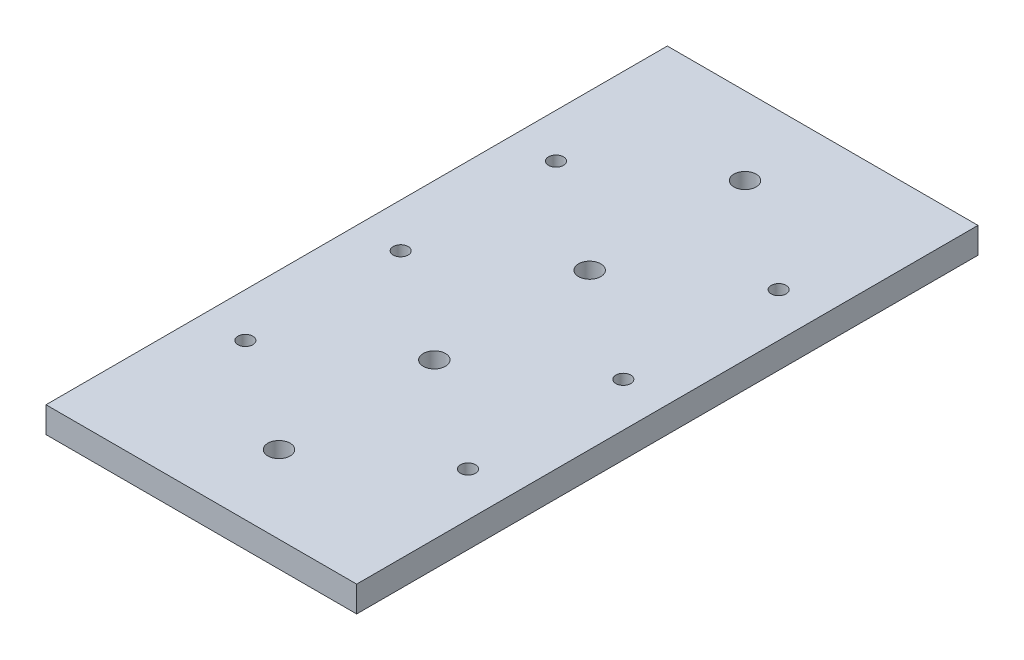
ISO-10303-21;
HEADER;
FILE_DESCRIPTION(('STEP AP214'),'2;1');
FILE_NAME('part.step','',(''),(''),'','','');
FILE_SCHEMA(('AUTOMOTIVE_DESIGN { 1 0 10303 214 1 1 1 1 }'));
ENDSEC;
DATA;
#1=APPLICATION_CONTEXT('core data for automotive mechanical design processes');
#2=APPLICATION_PROTOCOL_DEFINITION('international standard','automotive_design',2000,#1);
#3=PRODUCT_CONTEXT('',#1,'mechanical');
#4=PRODUCT('Part','Part','',(#3));
#5=PRODUCT_RELATED_PRODUCT_CATEGORY('part','',(#4));
#6=PRODUCT_DEFINITION_FORMATION('','',#4);
#7=PRODUCT_DEFINITION_CONTEXT('part definition',#1,'design');
#8=PRODUCT_DEFINITION('design','',#6,#7);
#9=PRODUCT_DEFINITION_SHAPE('','',#8);
#10=(LENGTH_UNIT() NAMED_UNIT(*) SI_UNIT(.MILLI.,.METRE.));
#11=(NAMED_UNIT(*) PLANE_ANGLE_UNIT() SI_UNIT($,.RADIAN.));
#12=(NAMED_UNIT(*) SI_UNIT($,.STERADIAN.) SOLID_ANGLE_UNIT());
#13=UNCERTAINTY_MEASURE_WITH_UNIT(LENGTH_MEASURE(1.E-05),#10,'distance_accuracy_value','');
#14=(GEOMETRIC_REPRESENTATION_CONTEXT(3) GLOBAL_UNCERTAINTY_ASSIGNED_CONTEXT((#13)) GLOBAL_UNIT_ASSIGNED_CONTEXT((#10,
#11,#12)) REPRESENTATION_CONTEXT('',''));
#15=CARTESIAN_POINT('',(0.,0.,0.));
#16=DIRECTION('',(0.,0.,1.));
#17=DIRECTION('',(1.,0.,0.));
#18=AXIS2_PLACEMENT_3D('',#15,#16,#17);
#19=CARTESIAN_POINT('',(38.1,-6.35,-76.2));
#20=DIRECTION('',(1.,0.,0.));
#21=DIRECTION('',(0.,0.,-1.));
#22=AXIS2_PLACEMENT_3D('',#19,#20,#21);
#23=PLANE('',#22);
#24=DIRECTION('',(0.,0.,-1.));
#25=VECTOR('',#24,1.);
#26=CARTESIAN_POINT('',(38.1,0.,-76.2));
#27=LINE('',#26,#25);
#28=CARTESIAN_POINT('',(38.1,0.,76.2));
#29=VERTEX_POINT('',#28);
#30=CARTESIAN_POINT('',(38.1,0.,-76.2));
#31=VERTEX_POINT('',#30);
#32=EDGE_CURVE('E99',#29,#31,#27,.T.);
#33=ORIENTED_EDGE('',*,*,#32,.F.);
#34=DIRECTION('',(0.,1.,0.));
#35=VECTOR('',#34,1.);
#36=CARTESIAN_POINT('',(38.1,-6.35,76.2));
#37=LINE('',#36,#35);
#38=CARTESIAN_POINT('',(38.1,-6.35,76.2));
#39=VERTEX_POINT('',#38);
#40=EDGE_CURVE('E11',#39,#29,#37,.T.);
#41=ORIENTED_EDGE('',*,*,#40,.F.);
#42=DIRECTION('',(0.,0.,-1.));
#43=VECTOR('',#42,1.);
#44=CARTESIAN_POINT('',(38.1,-6.35,-76.2));
#45=LINE('',#44,#43);
#46=CARTESIAN_POINT('',(38.1,-6.35,-76.2));
#47=VERTEX_POINT('',#46);
#48=EDGE_CURVE('E92',#39,#47,#45,.T.);
#49=ORIENTED_EDGE('',*,*,#48,.T.);
#50=DIRECTION('',(0.,1.,0.));
#51=VECTOR('',#50,1.);
#52=CARTESIAN_POINT('',(38.1,-6.35,-76.2));
#53=LINE('',#52,#51);
#54=EDGE_CURVE('E37',#47,#31,#53,.T.);
#55=ORIENTED_EDGE('',*,*,#54,.T.);
#56=EDGE_LOOP('',(#33,#41,#49,#55));
#57=FACE_BOUND('',#56,.T.);
#58=ADVANCED_FACE('F34',(#57),#23,.T.);
#59=CARTESIAN_POINT('',(-38.1,-6.35,76.2));
#60=DIRECTION('',(0.,0.,1.));
#61=DIRECTION('',(1.,0.,0.));
#62=AXIS2_PLACEMENT_3D('',#59,#60,#61);
#63=PLANE('',#62);
#64=DIRECTION('',(1.,0.,0.));
#65=VECTOR('',#64,1.);
#66=CARTESIAN_POINT('',(-38.1,0.,76.2));
#67=LINE('',#66,#65);
#68=CARTESIAN_POINT('',(-38.1,0.,76.2));
#69=VERTEX_POINT('',#68);
#70=EDGE_CURVE('E94',#69,#29,#67,.T.);
#71=ORIENTED_EDGE('',*,*,#70,.F.);
#72=DIRECTION('',(0.,1.,0.));
#73=VECTOR('',#72,1.);
#74=CARTESIAN_POINT('',(-38.1,-6.35,76.2));
#75=LINE('',#74,#73);
#76=CARTESIAN_POINT('',(-38.1,-6.35,76.2));
#77=VERTEX_POINT('',#76);
#78=EDGE_CURVE('E43',#77,#69,#75,.T.);
#79=ORIENTED_EDGE('',*,*,#78,.F.);
#80=DIRECTION('',(1.,0.,0.));
#81=VECTOR('',#80,1.);
#82=CARTESIAN_POINT('',(-38.1,-6.35,76.2));
#83=LINE('',#82,#81);
#84=EDGE_CURVE('E89',#77,#39,#83,.T.);
#85=ORIENTED_EDGE('',*,*,#84,.T.);
#86=ORIENTED_EDGE('',*,*,#40,.T.);
#87=EDGE_LOOP('',(#71,#79,#85,#86));
#88=FACE_BOUND('',#87,.T.);
#89=ADVANCED_FACE('F110',(#88),#63,.T.);
#90=CARTESIAN_POINT('',(-38.1,-6.35,-76.2));
#91=DIRECTION('',(-1.,0.,0.));
#92=DIRECTION('',(0.,0.,1.));
#93=AXIS2_PLACEMENT_3D('',#90,#91,#92);
#94=PLANE('',#93);
#95=DIRECTION('',(0.,0.,1.));
#96=VECTOR('',#95,1.);
#97=CARTESIAN_POINT('',(-38.1,0.,-76.2));
#98=LINE('',#97,#96);
#99=CARTESIAN_POINT('',(-38.1,0.,-76.2));
#100=VERTEX_POINT('',#99);
#101=EDGE_CURVE('E84',#100,#69,#98,.T.);
#102=ORIENTED_EDGE('',*,*,#101,.F.);
#103=DIRECTION('',(0.,1.,0.));
#104=VECTOR('',#103,1.);
#105=CARTESIAN_POINT('',(-38.1,-6.35,-76.2));
#106=LINE('',#105,#104);
#107=CARTESIAN_POINT('',(-38.1,-6.35,-76.2));
#108=VERTEX_POINT('',#107);
#109=EDGE_CURVE('E79',#108,#100,#106,.T.);
#110=ORIENTED_EDGE('',*,*,#109,.F.);
#111=DIRECTION('',(0.,0.,1.));
#112=VECTOR('',#111,1.);
#113=CARTESIAN_POINT('',(-38.1,-6.35,-76.2));
#114=LINE('',#113,#112);
#115=EDGE_CURVE('E82',#108,#77,#114,.T.);
#116=ORIENTED_EDGE('',*,*,#115,.T.);
#117=ORIENTED_EDGE('',*,*,#78,.T.);
#118=EDGE_LOOP('',(#102,#110,#116,#117));
#119=FACE_BOUND('',#118,.T.);
#120=ADVANCED_FACE('F81',(#119),#94,.T.);
#121=CARTESIAN_POINT('',(-38.1,-6.35,-76.2));
#122=DIRECTION('',(0.,0.,-1.));
#123=DIRECTION('',(-1.,0.,0.));
#124=AXIS2_PLACEMENT_3D('',#121,#122,#123);
#125=PLANE('',#124);
#126=DIRECTION('',(-1.,0.,0.));
#127=VECTOR('',#126,1.);
#128=CARTESIAN_POINT('',(-38.1,0.,-76.2));
#129=LINE('',#128,#127);
#130=EDGE_CURVE('E102',#31,#100,#129,.T.);
#131=ORIENTED_EDGE('',*,*,#130,.F.);
#132=ORIENTED_EDGE('',*,*,#54,.F.);
#133=DIRECTION('',(-1.,0.,0.));
#134=VECTOR('',#133,1.);
#135=CARTESIAN_POINT('',(-38.1,-6.35,-76.2));
#136=LINE('',#135,#134);
#137=EDGE_CURVE('E88',#47,#108,#136,.T.);
#138=ORIENTED_EDGE('',*,*,#137,.T.);
#139=ORIENTED_EDGE('',*,*,#109,.T.);
#140=EDGE_LOOP('',(#131,#132,#138,#139));
#141=FACE_BOUND('',#140,.T.);
#142=ADVANCED_FACE('F91',(#141),#125,.T.);
#143=CARTESIAN_POINT('',(0.,-6.35,0.));
#144=DIRECTION('',(0.,1.,0.));
#145=DIRECTION('',(0.,0.,1.));
#146=AXIS2_PLACEMENT_3D('',#143,#144,#145);
#147=PLANE('',#146);
#148=CARTESIAN_POINT('',(-27.305,-6.35,-38.1));
#149=DIRECTION('',(0.,1.,0.));
#150=DIRECTION('',(0.,0.,1.));
#151=AXIS2_PLACEMENT_3D('',#148,#149,#150);
#152=CIRCLE('',#151,1.8288);
#153=CARTESIAN_POINT('',(-27.305,-6.35,-36.2712));
#154=VERTEX_POINT('',#153);
#155=EDGE_CURVE('E175',#154,#154,#152,.T.);
#156=ORIENTED_EDGE('',*,*,#155,.T.);
#157=EDGE_LOOP('',(#156));
#158=FACE_BOUND('',#157,.T.);
#159=CARTESIAN_POINT('',(-27.305,-6.35,38.1));
#160=DIRECTION('',(0.,1.,0.));
#161=DIRECTION('',(0.,0.,1.));
#162=AXIS2_PLACEMENT_3D('',#159,#160,#161);
#163=CIRCLE('',#162,1.8288);
#164=CARTESIAN_POINT('',(-27.305,-6.35,39.9288));
#165=VERTEX_POINT('',#164);
#166=EDGE_CURVE('E183',#165,#165,#163,.T.);
#167=ORIENTED_EDGE('',*,*,#166,.T.);
#168=EDGE_LOOP('',(#167));
#169=FACE_BOUND('',#168,.T.);
#170=CARTESIAN_POINT('',(-27.305,-6.35,0.));
#171=DIRECTION('',(0.,1.,0.));
#172=DIRECTION('',(0.,0.,1.));
#173=AXIS2_PLACEMENT_3D('',#170,#171,#172);
#174=CIRCLE('',#173,1.8288);
#175=CARTESIAN_POINT('',(-27.305,-6.35,1.82879999999997));
#176=VERTEX_POINT('',#175);
#177=EDGE_CURVE('E189',#176,#176,#174,.T.);
#178=ORIENTED_EDGE('',*,*,#177,.T.);
#179=EDGE_LOOP('',(#178));
#180=FACE_BOUND('',#179,.T.);
#181=CARTESIAN_POINT('',(27.305,-6.35,38.1));
#182=DIRECTION('',(0.,1.,0.));
#183=DIRECTION('',(0.,0.,1.));
#184=AXIS2_PLACEMENT_3D('',#181,#182,#183);
#185=CIRCLE('',#184,1.8288);
#186=CARTESIAN_POINT('',(27.305,-6.35,39.9288));
#187=VERTEX_POINT('',#186);
#188=EDGE_CURVE('E195',#187,#187,#185,.T.);
#189=ORIENTED_EDGE('',*,*,#188,.T.);
#190=EDGE_LOOP('',(#189));
#191=FACE_BOUND('',#190,.T.);
#192=CARTESIAN_POINT('',(27.305,-6.35,0.));
#193=DIRECTION('',(0.,1.,0.));
#194=DIRECTION('',(0.,0.,1.));
#195=AXIS2_PLACEMENT_3D('',#192,#193,#194);
#196=CIRCLE('',#195,1.8288);
#197=CARTESIAN_POINT('',(27.305,-6.35,1.82879999999997));
#198=VERTEX_POINT('',#197);
#199=EDGE_CURVE('E201',#198,#198,#196,.T.);
#200=ORIENTED_EDGE('',*,*,#199,.T.);
#201=EDGE_LOOP('',(#200));
#202=FACE_BOUND('',#201,.T.);
#203=CARTESIAN_POINT('',(0.,-6.35,57.15));
#204=DIRECTION('',(0.,1.,0.));
#205=DIRECTION('',(0.,0.,1.));
#206=AXIS2_PLACEMENT_3D('',#203,#204,#205);
#207=CIRCLE('',#206,2.7305);
#208=CARTESIAN_POINT('',(0.,-6.35,59.8805));
#209=VERTEX_POINT('',#208);
#210=EDGE_CURVE('E207',#209,#209,#207,.T.);
#211=ORIENTED_EDGE('',*,*,#210,.T.);
#212=EDGE_LOOP('',(#211));
#213=FACE_BOUND('',#212,.T.);
#214=CARTESIAN_POINT('',(0.,-6.35,19.05));
#215=DIRECTION('',(0.,1.,0.));
#216=DIRECTION('',(0.,0.,1.));
#217=AXIS2_PLACEMENT_3D('',#214,#215,#216);
#218=CIRCLE('',#217,2.7305);
#219=CARTESIAN_POINT('',(0.,-6.35,21.7805));
#220=VERTEX_POINT('',#219);
#221=EDGE_CURVE('E213',#220,#220,#218,.T.);
#222=ORIENTED_EDGE('',*,*,#221,.T.);
#223=EDGE_LOOP('',(#222));
#224=FACE_BOUND('',#223,.T.);
#225=CARTESIAN_POINT('',(0.,-6.35,-19.05));
#226=DIRECTION('',(0.,1.,0.));
#227=DIRECTION('',(0.,0.,1.));
#228=AXIS2_PLACEMENT_3D('',#225,#226,#227);
#229=CIRCLE('',#228,2.7305);
#230=CARTESIAN_POINT('',(0.,-6.35,-16.3195));
#231=VERTEX_POINT('',#230);
#232=EDGE_CURVE('E219',#231,#231,#229,.T.);
#233=ORIENTED_EDGE('',*,*,#232,.T.);
#234=EDGE_LOOP('',(#233));
#235=FACE_BOUND('',#234,.T.);
#236=CARTESIAN_POINT('',(0.,-6.35,-57.15));
#237=DIRECTION('',(0.,1.,0.));
#238=DIRECTION('',(0.,0.,1.));
#239=AXIS2_PLACEMENT_3D('',#236,#237,#238);
#240=CIRCLE('',#239,2.7305);
#241=CARTESIAN_POINT('',(0.,-6.35,-54.4195));
#242=VERTEX_POINT('',#241);
#243=EDGE_CURVE('E225',#242,#242,#240,.T.);
#244=ORIENTED_EDGE('',*,*,#243,.T.);
#245=EDGE_LOOP('',(#244));
#246=FACE_BOUND('',#245,.T.);
#247=CARTESIAN_POINT('',(27.305,-6.35,-38.1));
#248=DIRECTION('',(0.,1.,0.));
#249=DIRECTION('',(0.,0.,1.));
#250=AXIS2_PLACEMENT_3D('',#247,#248,#249);
#251=CIRCLE('',#250,1.8288);
#252=CARTESIAN_POINT('',(27.305,-6.35,-36.2712));
#253=VERTEX_POINT('',#252);
#254=EDGE_CURVE('E103',#253,#253,#251,.T.);
#255=ORIENTED_EDGE('',*,*,#254,.T.);
#256=EDGE_LOOP('',(#255));
#257=FACE_BOUND('',#256,.T.);
#258=ORIENTED_EDGE('',*,*,#48,.F.);
#259=ORIENTED_EDGE('',*,*,#84,.F.);
#260=ORIENTED_EDGE('',*,*,#115,.F.);
#261=ORIENTED_EDGE('',*,*,#137,.F.);
#262=EDGE_LOOP('',(#258,#259,#260,#261));
#263=FACE_BOUND('',#262,.T.);
#264=ADVANCED_FACE('F87',(#158,#169,#180,#191,#202,#213,#224,#235,#246,#257,#263),#147,.F.);
#265=CARTESIAN_POINT('',(0.,0.,0.));
#266=DIRECTION('',(0.,1.,0.));
#267=DIRECTION('',(0.,0.,1.));
#268=AXIS2_PLACEMENT_3D('',#265,#266,#267);
#269=PLANE('',#268);
#270=CARTESIAN_POINT('',(-27.305,0.,-38.1));
#271=DIRECTION('',(0.,1.,0.));
#272=DIRECTION('',(0.,0.,1.));
#273=AXIS2_PLACEMENT_3D('',#270,#271,#272);
#274=CIRCLE('',#273,1.8288);
#275=CARTESIAN_POINT('',(-27.305,0.,-36.2712));
#276=VERTEX_POINT('',#275);
#277=EDGE_CURVE('E178',#276,#276,#274,.T.);
#278=ORIENTED_EDGE('',*,*,#277,.F.);
#279=EDGE_LOOP('',(#278));
#280=FACE_BOUND('',#279,.T.);
#281=CARTESIAN_POINT('',(-27.305,0.,38.1));
#282=DIRECTION('',(0.,1.,0.));
#283=DIRECTION('',(0.,0.,1.));
#284=AXIS2_PLACEMENT_3D('',#281,#282,#283);
#285=CIRCLE('',#284,1.8288);
#286=CARTESIAN_POINT('',(-27.305,0.,39.9288));
#287=VERTEX_POINT('',#286);
#288=EDGE_CURVE('E180',#287,#287,#285,.T.);
#289=ORIENTED_EDGE('',*,*,#288,.F.);
#290=EDGE_LOOP('',(#289));
#291=FACE_BOUND('',#290,.T.);
#292=CARTESIAN_POINT('',(-27.305,0.,0.));
#293=DIRECTION('',(0.,1.,0.));
#294=DIRECTION('',(0.,0.,1.));
#295=AXIS2_PLACEMENT_3D('',#292,#293,#294);
#296=CIRCLE('',#295,1.8288);
#297=CARTESIAN_POINT('',(-27.305,0.,1.82879999999997));
#298=VERTEX_POINT('',#297);
#299=EDGE_CURVE('E186',#298,#298,#296,.T.);
#300=ORIENTED_EDGE('',*,*,#299,.F.);
#301=EDGE_LOOP('',(#300));
#302=FACE_BOUND('',#301,.T.);
#303=CARTESIAN_POINT('',(27.305,0.,38.1));
#304=DIRECTION('',(0.,1.,0.));
#305=DIRECTION('',(0.,0.,1.));
#306=AXIS2_PLACEMENT_3D('',#303,#304,#305);
#307=CIRCLE('',#306,1.8288);
#308=CARTESIAN_POINT('',(27.305,0.,39.9288));
#309=VERTEX_POINT('',#308);
#310=EDGE_CURVE('E192',#309,#309,#307,.T.);
#311=ORIENTED_EDGE('',*,*,#310,.F.);
#312=EDGE_LOOP('',(#311));
#313=FACE_BOUND('',#312,.T.);
#314=CARTESIAN_POINT('',(27.305,0.,0.));
#315=DIRECTION('',(0.,1.,0.));
#316=DIRECTION('',(0.,0.,1.));
#317=AXIS2_PLACEMENT_3D('',#314,#315,#316);
#318=CIRCLE('',#317,1.8288);
#319=CARTESIAN_POINT('',(27.305,0.,1.82879999999997));
#320=VERTEX_POINT('',#319);
#321=EDGE_CURVE('E198',#320,#320,#318,.T.);
#322=ORIENTED_EDGE('',*,*,#321,.F.);
#323=EDGE_LOOP('',(#322));
#324=FACE_BOUND('',#323,.T.);
#325=CARTESIAN_POINT('',(0.,0.,57.15));
#326=DIRECTION('',(0.,1.,0.));
#327=DIRECTION('',(0.,0.,1.));
#328=AXIS2_PLACEMENT_3D('',#325,#326,#327);
#329=CIRCLE('',#328,2.7305);
#330=CARTESIAN_POINT('',(0.,0.,59.8805));
#331=VERTEX_POINT('',#330);
#332=EDGE_CURVE('E204',#331,#331,#329,.T.);
#333=ORIENTED_EDGE('',*,*,#332,.F.);
#334=EDGE_LOOP('',(#333));
#335=FACE_BOUND('',#334,.T.);
#336=CARTESIAN_POINT('',(0.,0.,19.05));
#337=DIRECTION('',(0.,1.,0.));
#338=DIRECTION('',(0.,0.,1.));
#339=AXIS2_PLACEMENT_3D('',#336,#337,#338);
#340=CIRCLE('',#339,2.7305);
#341=CARTESIAN_POINT('',(0.,0.,21.7805));
#342=VERTEX_POINT('',#341);
#343=EDGE_CURVE('E210',#342,#342,#340,.T.);
#344=ORIENTED_EDGE('',*,*,#343,.F.);
#345=EDGE_LOOP('',(#344));
#346=FACE_BOUND('',#345,.T.);
#347=CARTESIAN_POINT('',(0.,0.,-19.05));
#348=DIRECTION('',(0.,1.,0.));
#349=DIRECTION('',(0.,0.,1.));
#350=AXIS2_PLACEMENT_3D('',#347,#348,#349);
#351=CIRCLE('',#350,2.7305);
#352=CARTESIAN_POINT('',(0.,0.,-16.3195));
#353=VERTEX_POINT('',#352);
#354=EDGE_CURVE('E216',#353,#353,#351,.T.);
#355=ORIENTED_EDGE('',*,*,#354,.F.);
#356=EDGE_LOOP('',(#355));
#357=FACE_BOUND('',#356,.T.);
#358=CARTESIAN_POINT('',(0.,0.,-57.15));
#359=DIRECTION('',(0.,1.,0.));
#360=DIRECTION('',(0.,0.,1.));
#361=AXIS2_PLACEMENT_3D('',#358,#359,#360);
#362=CIRCLE('',#361,2.7305);
#363=CARTESIAN_POINT('',(0.,0.,-54.4195));
#364=VERTEX_POINT('',#363);
#365=EDGE_CURVE('E222',#364,#364,#362,.T.);
#366=ORIENTED_EDGE('',*,*,#365,.F.);
#367=EDGE_LOOP('',(#366));
#368=FACE_BOUND('',#367,.T.);
#369=CARTESIAN_POINT('',(27.305,0.,-38.1));
#370=DIRECTION('',(0.,1.,0.));
#371=DIRECTION('',(0.,0.,1.));
#372=AXIS2_PLACEMENT_3D('',#369,#370,#371);
#373=CIRCLE('',#372,1.8288);
#374=CARTESIAN_POINT('',(27.305,0.,-36.2712));
#375=VERTEX_POINT('',#374);
#376=EDGE_CURVE('E228',#375,#375,#373,.T.);
#377=ORIENTED_EDGE('',*,*,#376,.F.);
#378=EDGE_LOOP('',(#377));
#379=FACE_BOUND('',#378,.T.);
#380=ORIENTED_EDGE('',*,*,#32,.T.);
#381=ORIENTED_EDGE('',*,*,#130,.T.);
#382=ORIENTED_EDGE('',*,*,#101,.T.);
#383=ORIENTED_EDGE('',*,*,#70,.T.);
#384=EDGE_LOOP('',(#380,#381,#382,#383));
#385=FACE_BOUND('',#384,.T.);
#386=ADVANCED_FACE('F109',(#280,#291,#302,#313,#324,#335,#346,#357,#368,#379,#385),#269,.T.);
#387=CARTESIAN_POINT('',(27.305,-6.35,-38.1));
#388=DIRECTION('',(0.,1.,0.));
#389=DIRECTION('',(0.,0.,1.));
#390=AXIS2_PLACEMENT_3D('',#387,#388,#389);
#391=CYLINDRICAL_SURFACE('',#390,1.8288);
#392=ORIENTED_EDGE('',*,*,#254,.F.);
#393=EDGE_LOOP('',(#392));
#394=FACE_BOUND('',#393,.T.);
#395=ORIENTED_EDGE('',*,*,#376,.T.);
#396=EDGE_LOOP('',(#395));
#397=FACE_BOUND('',#396,.T.);
#398=ADVANCED_FACE('F128',(#394,#397),#391,.F.);
#399=CARTESIAN_POINT('',(0.,-6.35,-57.15));
#400=DIRECTION('',(0.,1.,0.));
#401=DIRECTION('',(0.,0.,1.));
#402=AXIS2_PLACEMENT_3D('',#399,#400,#401);
#403=CYLINDRICAL_SURFACE('',#402,2.7305);
#404=ORIENTED_EDGE('',*,*,#243,.F.);
#405=EDGE_LOOP('',(#404));
#406=FACE_BOUND('',#405,.T.);
#407=ORIENTED_EDGE('',*,*,#365,.T.);
#408=EDGE_LOOP('',(#407));
#409=FACE_BOUND('',#408,.T.);
#410=ADVANCED_FACE('F135',(#406,#409),#403,.F.);
#411=CARTESIAN_POINT('',(0.,-6.35,-19.05));
#412=DIRECTION('',(0.,1.,0.));
#413=DIRECTION('',(0.,0.,1.));
#414=AXIS2_PLACEMENT_3D('',#411,#412,#413);
#415=CYLINDRICAL_SURFACE('',#414,2.7305);
#416=ORIENTED_EDGE('',*,*,#232,.F.);
#417=EDGE_LOOP('',(#416));
#418=FACE_BOUND('',#417,.T.);
#419=ORIENTED_EDGE('',*,*,#354,.T.);
#420=EDGE_LOOP('',(#419));
#421=FACE_BOUND('',#420,.T.);
#422=ADVANCED_FACE('F139',(#418,#421),#415,.F.);
#423=CARTESIAN_POINT('',(0.,-6.35,19.05));
#424=DIRECTION('',(0.,1.,0.));
#425=DIRECTION('',(0.,0.,1.));
#426=AXIS2_PLACEMENT_3D('',#423,#424,#425);
#427=CYLINDRICAL_SURFACE('',#426,2.7305);
#428=ORIENTED_EDGE('',*,*,#221,.F.);
#429=EDGE_LOOP('',(#428));
#430=FACE_BOUND('',#429,.T.);
#431=ORIENTED_EDGE('',*,*,#343,.T.);
#432=EDGE_LOOP('',(#431));
#433=FACE_BOUND('',#432,.T.);
#434=ADVANCED_FACE('F143',(#430,#433),#427,.F.);
#435=CARTESIAN_POINT('',(0.,-6.35,57.15));
#436=DIRECTION('',(0.,1.,0.));
#437=DIRECTION('',(0.,0.,1.));
#438=AXIS2_PLACEMENT_3D('',#435,#436,#437);
#439=CYLINDRICAL_SURFACE('',#438,2.7305);
#440=ORIENTED_EDGE('',*,*,#210,.F.);
#441=EDGE_LOOP('',(#440));
#442=FACE_BOUND('',#441,.T.);
#443=ORIENTED_EDGE('',*,*,#332,.T.);
#444=EDGE_LOOP('',(#443));
#445=FACE_BOUND('',#444,.T.);
#446=ADVANCED_FACE('F147',(#442,#445),#439,.F.);
#447=CARTESIAN_POINT('',(27.305,-6.35,0.));
#448=DIRECTION('',(0.,1.,0.));
#449=DIRECTION('',(0.,0.,1.));
#450=AXIS2_PLACEMENT_3D('',#447,#448,#449);
#451=CYLINDRICAL_SURFACE('',#450,1.8288);
#452=ORIENTED_EDGE('',*,*,#199,.F.);
#453=EDGE_LOOP('',(#452));
#454=FACE_BOUND('',#453,.T.);
#455=ORIENTED_EDGE('',*,*,#321,.T.);
#456=EDGE_LOOP('',(#455));
#457=FACE_BOUND('',#456,.T.);
#458=ADVANCED_FACE('F151',(#454,#457),#451,.F.);
#459=CARTESIAN_POINT('',(27.305,-6.35,38.1));
#460=DIRECTION('',(0.,1.,0.));
#461=DIRECTION('',(0.,0.,1.));
#462=AXIS2_PLACEMENT_3D('',#459,#460,#461);
#463=CYLINDRICAL_SURFACE('',#462,1.8288);
#464=ORIENTED_EDGE('',*,*,#188,.F.);
#465=EDGE_LOOP('',(#464));
#466=FACE_BOUND('',#465,.T.);
#467=ORIENTED_EDGE('',*,*,#310,.T.);
#468=EDGE_LOOP('',(#467));
#469=FACE_BOUND('',#468,.T.);
#470=ADVANCED_FACE('F155',(#466,#469),#463,.F.);
#471=CARTESIAN_POINT('',(-27.305,-6.35,0.));
#472=DIRECTION('',(0.,1.,0.));
#473=DIRECTION('',(0.,0.,1.));
#474=AXIS2_PLACEMENT_3D('',#471,#472,#473);
#475=CYLINDRICAL_SURFACE('',#474,1.8288);
#476=ORIENTED_EDGE('',*,*,#177,.F.);
#477=EDGE_LOOP('',(#476));
#478=FACE_BOUND('',#477,.T.);
#479=ORIENTED_EDGE('',*,*,#299,.T.);
#480=EDGE_LOOP('',(#479));
#481=FACE_BOUND('',#480,.T.);
#482=ADVANCED_FACE('F159',(#478,#481),#475,.F.);
#483=CARTESIAN_POINT('',(-27.305,-6.35,38.1));
#484=DIRECTION('',(0.,1.,0.));
#485=DIRECTION('',(0.,0.,1.));
#486=AXIS2_PLACEMENT_3D('',#483,#484,#485);
#487=CYLINDRICAL_SURFACE('',#486,1.8288);
#488=ORIENTED_EDGE('',*,*,#166,.F.);
#489=EDGE_LOOP('',(#488));
#490=FACE_BOUND('',#489,.T.);
#491=ORIENTED_EDGE('',*,*,#288,.T.);
#492=EDGE_LOOP('',(#491));
#493=FACE_BOUND('',#492,.T.);
#494=ADVANCED_FACE('F163',(#490,#493),#487,.F.);
#495=CARTESIAN_POINT('',(-27.305,-6.35,-38.1));
#496=DIRECTION('',(0.,1.,0.));
#497=DIRECTION('',(0.,0.,1.));
#498=AXIS2_PLACEMENT_3D('',#495,#496,#497);
#499=CYLINDRICAL_SURFACE('',#498,1.8288);
#500=ORIENTED_EDGE('',*,*,#155,.F.);
#501=EDGE_LOOP('',(#500));
#502=FACE_BOUND('',#501,.T.);
#503=ORIENTED_EDGE('',*,*,#277,.T.);
#504=EDGE_LOOP('',(#503));
#505=FACE_BOUND('',#504,.T.);
#506=ADVANCED_FACE('F167',(#502,#505),#499,.F.);
#507=CLOSED_SHELL('',(#58,#89,#120,#142,#264,#386,#398,#410,#422,#434,#446,#458,#470,#482,#494,#506));
#508=MANIFOLD_SOLID_BREP('B2',#507);
#509=ADVANCED_BREP_SHAPE_REPRESENTATION('',(#18,#508),#14);
#510=SHAPE_DEFINITION_REPRESENTATION(#9,#509);
ENDSEC;
END-ISO-10303-21;
